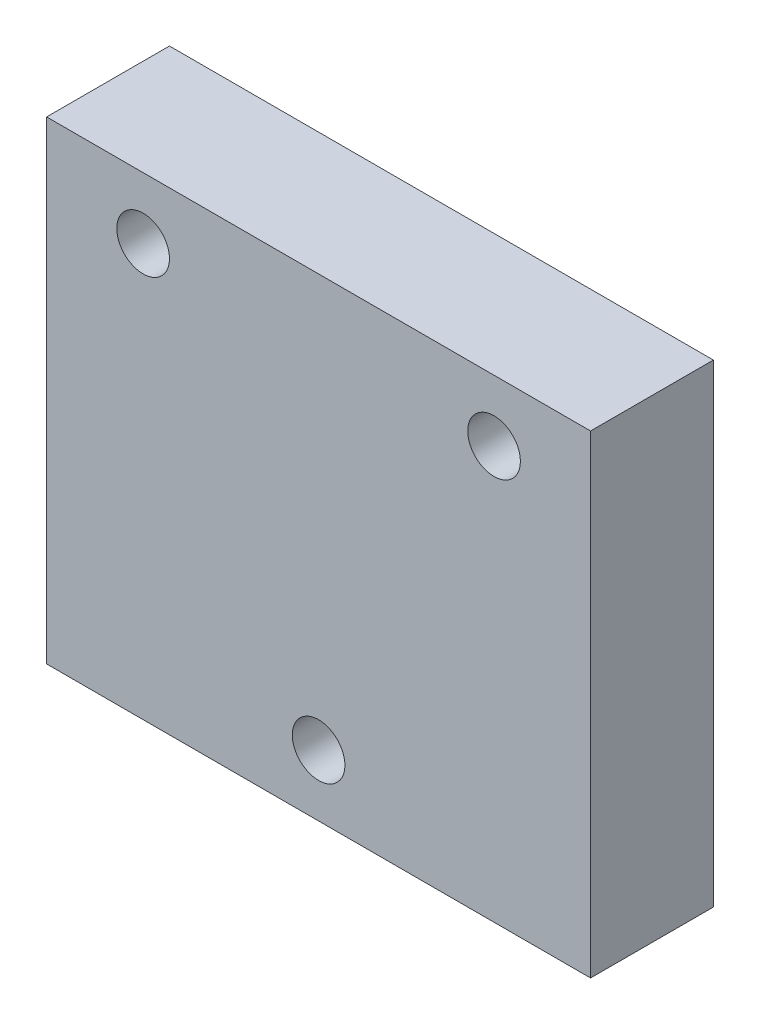
ISO-10303-21;
HEADER;
FILE_DESCRIPTION(('STEP AP214'),'2;1');
FILE_NAME('part.step','',(''),(''),'','','');
FILE_SCHEMA(('AUTOMOTIVE_DESIGN { 1 0 10303 214 1 1 1 1 }'));
ENDSEC;
DATA;
#1=APPLICATION_CONTEXT('core data for automotive mechanical design processes');
#2=APPLICATION_PROTOCOL_DEFINITION('international standard','automotive_design',2000,#1);
#3=PRODUCT_CONTEXT('',#1,'mechanical');
#4=PRODUCT('Part','Part','',(#3));
#5=PRODUCT_RELATED_PRODUCT_CATEGORY('part','',(#4));
#6=PRODUCT_DEFINITION_FORMATION('','',#4);
#7=PRODUCT_DEFINITION_CONTEXT('part definition',#1,'design');
#8=PRODUCT_DEFINITION('design','',#6,#7);
#9=PRODUCT_DEFINITION_SHAPE('','',#8);
#10=(LENGTH_UNIT() NAMED_UNIT(*) SI_UNIT(.MILLI.,.METRE.));
#11=(NAMED_UNIT(*) PLANE_ANGLE_UNIT() SI_UNIT($,.RADIAN.));
#12=(NAMED_UNIT(*) SI_UNIT($,.STERADIAN.) SOLID_ANGLE_UNIT());
#13=UNCERTAINTY_MEASURE_WITH_UNIT(LENGTH_MEASURE(1.E-05),#10,'distance_accuracy_value','');
#14=(GEOMETRIC_REPRESENTATION_CONTEXT(3) GLOBAL_UNCERTAINTY_ASSIGNED_CONTEXT((#13)) GLOBAL_UNIT_ASSIGNED_CONTEXT((#10,
#11,#12)) REPRESENTATION_CONTEXT('',''));
#15=CARTESIAN_POINT('',(0.,0.,0.));
#16=DIRECTION('',(0.,0.,1.));
#17=DIRECTION('',(1.,0.,0.));
#18=AXIS2_PLACEMENT_3D('',#15,#16,#17);
#19=CARTESIAN_POINT('',(15.5,13.5,7.));
#20=DIRECTION('',(-1.,0.,0.));
#21=DIRECTION('',(0.,-1.,0.));
#22=AXIS2_PLACEMENT_3D('',#19,#20,#21);
#23=PLANE('',#22);
#24=DIRECTION('',(0.,1.,0.));
#25=VECTOR('',#24,1.);
#26=CARTESIAN_POINT('',(15.5,13.5,0.));
#27=LINE('',#26,#25);
#28=CARTESIAN_POINT('',(15.5,-13.5,0.));
#29=VERTEX_POINT('',#28);
#30=CARTESIAN_POINT('',(15.5,13.5,0.));
#31=VERTEX_POINT('',#30);
#32=EDGE_CURVE('E98',#29,#31,#27,.T.);
#33=ORIENTED_EDGE('',*,*,#32,.T.);
#34=DIRECTION('',(0.,0.,-1.));
#35=VECTOR('',#34,1.);
#36=CARTESIAN_POINT('',(15.5,13.5,7.));
#37=LINE('',#36,#35);
#38=CARTESIAN_POINT('',(15.5,13.5,7.));
#39=VERTEX_POINT('',#38);
#40=EDGE_CURVE('E11',#39,#31,#37,.T.);
#41=ORIENTED_EDGE('',*,*,#40,.F.);
#42=DIRECTION('',(0.,1.,0.));
#43=VECTOR('',#42,1.);
#44=CARTESIAN_POINT('',(15.5,13.5,7.));
#45=LINE('',#44,#43);
#46=CARTESIAN_POINT('',(15.5,-13.5,7.));
#47=VERTEX_POINT('',#46);
#48=EDGE_CURVE('E86',#47,#39,#45,.T.);
#49=ORIENTED_EDGE('',*,*,#48,.F.);
#50=DIRECTION('',(0.,0.,-1.));
#51=VECTOR('',#50,1.);
#52=CARTESIAN_POINT('',(15.5,-13.5,7.));
#53=LINE('',#52,#51);
#54=EDGE_CURVE('E94',#47,#29,#53,.T.);
#55=ORIENTED_EDGE('',*,*,#54,.T.);
#56=EDGE_LOOP('',(#33,#41,#49,#55));
#57=FACE_BOUND('',#56,.T.);
#58=ADVANCED_FACE('F35',(#57),#23,.F.);
#59=CARTESIAN_POINT('',(-15.5,13.5,7.));
#60=DIRECTION('',(0.,-1.,0.));
#61=DIRECTION('',(0.,0.,-1.));
#62=AXIS2_PLACEMENT_3D('',#59,#60,#61);
#63=PLANE('',#62);
#64=DIRECTION('',(-1.,0.,0.));
#65=VECTOR('',#64,1.);
#66=CARTESIAN_POINT('',(-15.5,13.5,0.));
#67=LINE('',#66,#65);
#68=CARTESIAN_POINT('',(-15.5,13.5,0.));
#69=VERTEX_POINT('',#68);
#70=EDGE_CURVE('E90',#31,#69,#67,.T.);
#71=ORIENTED_EDGE('',*,*,#70,.T.);
#72=DIRECTION('',(0.,0.,-1.));
#73=VECTOR('',#72,1.);
#74=CARTESIAN_POINT('',(-15.5,13.5,7.));
#75=LINE('',#74,#73);
#76=CARTESIAN_POINT('',(-15.5,13.5,7.));
#77=VERTEX_POINT('',#76);
#78=EDGE_CURVE('E43',#77,#69,#75,.T.);
#79=ORIENTED_EDGE('',*,*,#78,.F.);
#80=DIRECTION('',(-1.,0.,0.));
#81=VECTOR('',#80,1.);
#82=CARTESIAN_POINT('',(-15.5,13.5,7.));
#83=LINE('',#82,#81);
#84=EDGE_CURVE('E81',#39,#77,#83,.T.);
#85=ORIENTED_EDGE('',*,*,#84,.F.);
#86=ORIENTED_EDGE('',*,*,#40,.T.);
#87=EDGE_LOOP('',(#71,#79,#85,#86));
#88=FACE_BOUND('',#87,.T.);
#89=ADVANCED_FACE('F89',(#88),#63,.F.);
#90=CARTESIAN_POINT('',(-15.5,13.5,7.));
#91=DIRECTION('',(1.,0.,0.));
#92=DIRECTION('',(0.,1.,0.));
#93=AXIS2_PLACEMENT_3D('',#90,#91,#92);
#94=PLANE('',#93);
#95=DIRECTION('',(0.,-1.,0.));
#96=VECTOR('',#95,1.);
#97=CARTESIAN_POINT('',(-15.5,13.5,0.));
#98=LINE('',#97,#96);
#99=CARTESIAN_POINT('',(-15.5,-13.5,0.));
#100=VERTEX_POINT('',#99);
#101=EDGE_CURVE('E68',#69,#100,#98,.T.);
#102=ORIENTED_EDGE('',*,*,#101,.T.);
#103=DIRECTION('',(0.,0.,-1.));
#104=VECTOR('',#103,1.);
#105=CARTESIAN_POINT('',(-15.5,-13.5,7.));
#106=LINE('',#105,#104);
#107=CARTESIAN_POINT('',(-15.5,-13.5,7.));
#108=VERTEX_POINT('',#107);
#109=EDGE_CURVE('E91',#108,#100,#106,.T.);
#110=ORIENTED_EDGE('',*,*,#109,.F.);
#111=DIRECTION('',(0.,-1.,0.));
#112=VECTOR('',#111,1.);
#113=CARTESIAN_POINT('',(-15.5,13.5,7.));
#114=LINE('',#113,#112);
#115=EDGE_CURVE('E84',#77,#108,#114,.T.);
#116=ORIENTED_EDGE('',*,*,#115,.F.);
#117=ORIENTED_EDGE('',*,*,#78,.T.);
#118=EDGE_LOOP('',(#102,#110,#116,#117));
#119=FACE_BOUND('',#118,.T.);
#120=ADVANCED_FACE('F92',(#119),#94,.F.);
#121=CARTESIAN_POINT('',(-15.5,-13.5,7.));
#122=DIRECTION('',(0.,1.,0.));
#123=DIRECTION('',(0.,0.,1.));
#124=AXIS2_PLACEMENT_3D('',#121,#122,#123);
#125=PLANE('',#124);
#126=DIRECTION('',(1.,0.,0.));
#127=VECTOR('',#126,1.);
#128=CARTESIAN_POINT('',(-15.5,-13.5,0.));
#129=LINE('',#128,#127);
#130=EDGE_CURVE('E74',#100,#29,#129,.T.);
#131=ORIENTED_EDGE('',*,*,#130,.T.);
#132=ORIENTED_EDGE('',*,*,#54,.F.);
#133=DIRECTION('',(1.,0.,0.));
#134=VECTOR('',#133,1.);
#135=CARTESIAN_POINT('',(-15.5,-13.5,7.));
#136=LINE('',#135,#134);
#137=EDGE_CURVE('E51',#108,#47,#136,.T.);
#138=ORIENTED_EDGE('',*,*,#137,.F.);
#139=ORIENTED_EDGE('',*,*,#109,.T.);
#140=EDGE_LOOP('',(#131,#132,#138,#139));
#141=FACE_BOUND('',#140,.T.);
#142=ADVANCED_FACE('F106',(#141),#125,.F.);
#143=CARTESIAN_POINT('',(0.,0.,7.));
#144=DIRECTION('',(0.,0.,1.));
#145=DIRECTION('',(1.,0.,0.));
#146=AXIS2_PLACEMENT_3D('',#143,#144,#145);
#147=PLANE('',#146);
#148=CARTESIAN_POINT('',(10.,10.,7.));
#149=DIRECTION('',(0.,0.,1.));
#150=DIRECTION('',(1.,0.,0.));
#151=AXIS2_PLACEMENT_3D('',#148,#149,#150);
#152=CIRCLE('',#151,1.5);
#153=CARTESIAN_POINT('',(11.5,10.,7.));
#154=VERTEX_POINT('',#153);
#155=EDGE_CURVE('E124',#154,#154,#152,.T.);
#156=ORIENTED_EDGE('',*,*,#155,.F.);
#157=EDGE_LOOP('',(#156));
#158=FACE_BOUND('',#157,.T.);
#159=CARTESIAN_POINT('',(0.,-10.,7.));
#160=DIRECTION('',(0.,0.,1.));
#161=DIRECTION('',(1.,0.,0.));
#162=AXIS2_PLACEMENT_3D('',#159,#160,#161);
#163=CIRCLE('',#162,1.5);
#164=CARTESIAN_POINT('',(1.5,-10.,7.));
#165=VERTEX_POINT('',#164);
#166=EDGE_CURVE('E118',#165,#165,#163,.T.);
#167=ORIENTED_EDGE('',*,*,#166,.F.);
#168=EDGE_LOOP('',(#167));
#169=FACE_BOUND('',#168,.T.);
#170=CARTESIAN_POINT('',(-10.,10.,7.));
#171=DIRECTION('',(0.,0.,1.));
#172=DIRECTION('',(1.,0.,0.));
#173=AXIS2_PLACEMENT_3D('',#170,#171,#172);
#174=CIRCLE('',#173,1.5);
#175=CARTESIAN_POINT('',(-8.5,10.,7.));
#176=VERTEX_POINT('',#175);
#177=EDGE_CURVE('E112',#176,#176,#174,.T.);
#178=ORIENTED_EDGE('',*,*,#177,.F.);
#179=EDGE_LOOP('',(#178));
#180=FACE_BOUND('',#179,.T.);
#181=ORIENTED_EDGE('',*,*,#48,.T.);
#182=ORIENTED_EDGE('',*,*,#84,.T.);
#183=ORIENTED_EDGE('',*,*,#115,.T.);
#184=ORIENTED_EDGE('',*,*,#137,.T.);
#185=EDGE_LOOP('',(#181,#182,#183,#184));
#186=FACE_BOUND('',#185,.T.);
#187=ADVANCED_FACE('F82',(#158,#169,#180,#186),#147,.T.);
#188=CARTESIAN_POINT('',(0.,0.,0.));
#189=DIRECTION('',(0.,0.,1.));
#190=DIRECTION('',(1.,0.,0.));
#191=AXIS2_PLACEMENT_3D('',#188,#189,#190);
#192=PLANE('',#191);
#193=CARTESIAN_POINT('',(10.,10.,0.));
#194=DIRECTION('',(0.,0.,1.));
#195=DIRECTION('',(1.,0.,0.));
#196=AXIS2_PLACEMENT_3D('',#193,#194,#195);
#197=CIRCLE('',#196,1.5);
#198=CARTESIAN_POINT('',(11.5,10.,0.));
#199=VERTEX_POINT('',#198);
#200=EDGE_CURVE('E115',#199,#199,#197,.T.);
#201=ORIENTED_EDGE('',*,*,#200,.T.);
#202=EDGE_LOOP('',(#201));
#203=FACE_BOUND('',#202,.T.);
#204=CARTESIAN_POINT('',(0.,-10.,0.));
#205=DIRECTION('',(0.,0.,1.));
#206=DIRECTION('',(1.,0.,0.));
#207=AXIS2_PLACEMENT_3D('',#204,#205,#206);
#208=CIRCLE('',#207,1.5);
#209=CARTESIAN_POINT('',(1.5,-10.,0.));
#210=VERTEX_POINT('',#209);
#211=EDGE_CURVE('E121',#210,#210,#208,.T.);
#212=ORIENTED_EDGE('',*,*,#211,.T.);
#213=EDGE_LOOP('',(#212));
#214=FACE_BOUND('',#213,.T.);
#215=CARTESIAN_POINT('',(-10.,10.,0.));
#216=DIRECTION('',(0.,0.,1.));
#217=DIRECTION('',(1.,0.,0.));
#218=AXIS2_PLACEMENT_3D('',#215,#216,#217);
#219=CIRCLE('',#218,1.5);
#220=CARTESIAN_POINT('',(-8.5,10.,0.));
#221=VERTEX_POINT('',#220);
#222=EDGE_CURVE('E101',#221,#221,#219,.T.);
#223=ORIENTED_EDGE('',*,*,#222,.T.);
#224=EDGE_LOOP('',(#223));
#225=FACE_BOUND('',#224,.T.);
#226=ORIENTED_EDGE('',*,*,#32,.F.);
#227=ORIENTED_EDGE('',*,*,#130,.F.);
#228=ORIENTED_EDGE('',*,*,#101,.F.);
#229=ORIENTED_EDGE('',*,*,#70,.F.);
#230=EDGE_LOOP('',(#226,#227,#228,#229));
#231=FACE_BOUND('',#230,.T.);
#232=ADVANCED_FACE('F109',(#203,#214,#225,#231),#192,.F.);
#233=CARTESIAN_POINT('',(-10.,10.,0.));
#234=DIRECTION('',(0.,0.,1.));
#235=DIRECTION('',(1.,0.,0.));
#236=AXIS2_PLACEMENT_3D('',#233,#234,#235);
#237=CYLINDRICAL_SURFACE('',#236,1.5);
#238=ORIENTED_EDGE('',*,*,#222,.F.);
#239=EDGE_LOOP('',(#238));
#240=FACE_BOUND('',#239,.T.);
#241=ORIENTED_EDGE('',*,*,#177,.T.);
#242=EDGE_LOOP('',(#241));
#243=FACE_BOUND('',#242,.T.);
#244=ADVANCED_FACE('F146',(#240,#243),#237,.F.);
#245=CARTESIAN_POINT('',(0.,-10.,0.));
#246=DIRECTION('',(0.,0.,1.));
#247=DIRECTION('',(1.,0.,0.));
#248=AXIS2_PLACEMENT_3D('',#245,#246,#247);
#249=CYLINDRICAL_SURFACE('',#248,1.5);
#250=ORIENTED_EDGE('',*,*,#211,.F.);
#251=EDGE_LOOP('',(#250));
#252=FACE_BOUND('',#251,.T.);
#253=ORIENTED_EDGE('',*,*,#166,.T.);
#254=EDGE_LOOP('',(#253));
#255=FACE_BOUND('',#254,.T.);
#256=ADVANCED_FACE('F135',(#252,#255),#249,.F.);
#257=CARTESIAN_POINT('',(10.,10.,0.));
#258=DIRECTION('',(0.,0.,1.));
#259=DIRECTION('',(1.,0.,0.));
#260=AXIS2_PLACEMENT_3D('',#257,#258,#259);
#261=CYLINDRICAL_SURFACE('',#260,1.5);
#262=ORIENTED_EDGE('',*,*,#200,.F.);
#263=EDGE_LOOP('',(#262));
#264=FACE_BOUND('',#263,.T.);
#265=ORIENTED_EDGE('',*,*,#155,.T.);
#266=EDGE_LOOP('',(#265));
#267=FACE_BOUND('',#266,.T.);
#268=ADVANCED_FACE('F132',(#264,#267),#261,.F.);
#269=CLOSED_SHELL('',(#58,#89,#120,#142,#187,#232,#244,#256,#268));
#270=MANIFOLD_SOLID_BREP('B2',#269);
#271=ADVANCED_BREP_SHAPE_REPRESENTATION('',(#18,#270),#14);
#272=SHAPE_DEFINITION_REPRESENTATION(#9,#271);
ENDSEC;
END-ISO-10303-21;
